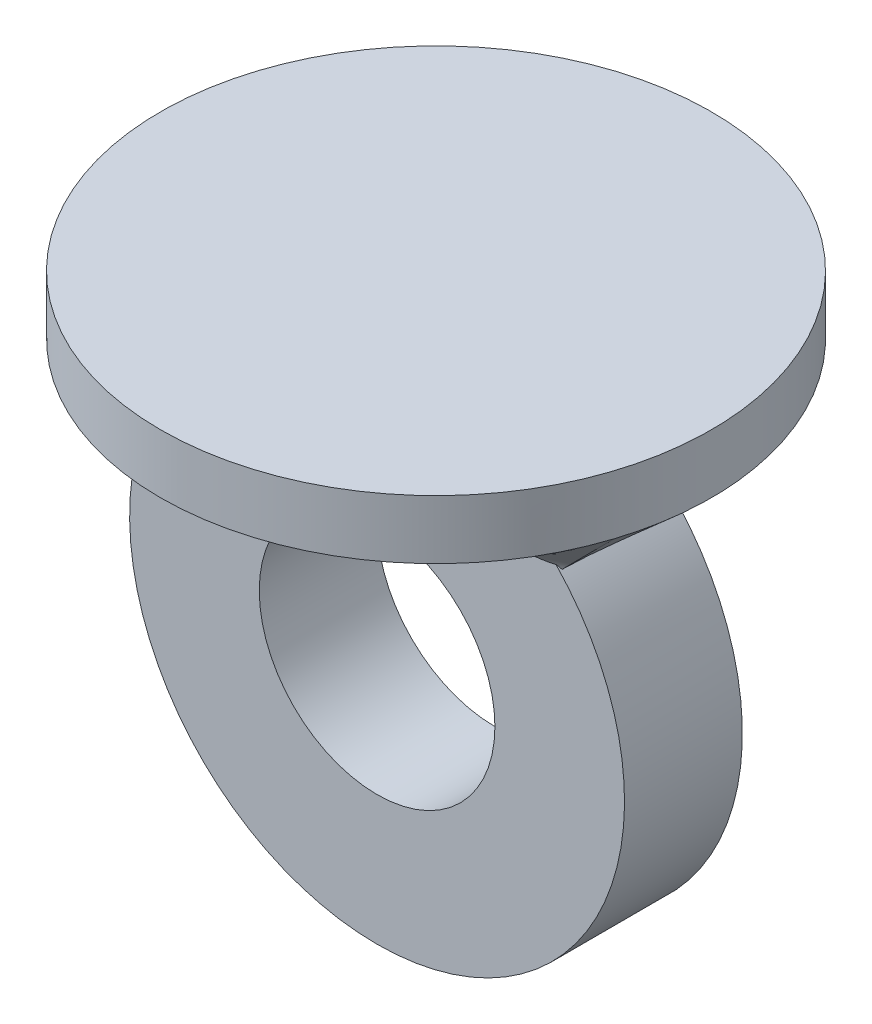
ISO-10303-21;
HEADER;
FILE_DESCRIPTION(('STEP AP214'),'2;1');
FILE_NAME('part.step','',(''),(''),'','','');
FILE_SCHEMA(('AUTOMOTIVE_DESIGN { 1 0 10303 214 1 1 1 1 }'));
ENDSEC;
DATA;
#1=APPLICATION_CONTEXT('core data for automotive mechanical design processes');
#2=APPLICATION_PROTOCOL_DEFINITION('international standard','automotive_design',2000,#1);
#3=PRODUCT_CONTEXT('',#1,'mechanical');
#4=PRODUCT('Part','Part','',(#3));
#5=PRODUCT_RELATED_PRODUCT_CATEGORY('part','',(#4));
#6=PRODUCT_DEFINITION_FORMATION('','',#4);
#7=PRODUCT_DEFINITION_CONTEXT('part definition',#1,'design');
#8=PRODUCT_DEFINITION('design','',#6,#7);
#9=PRODUCT_DEFINITION_SHAPE('','',#8);
#10=(LENGTH_UNIT() NAMED_UNIT(*) SI_UNIT(.MILLI.,.METRE.));
#11=(NAMED_UNIT(*) PLANE_ANGLE_UNIT() SI_UNIT($,.RADIAN.));
#12=(NAMED_UNIT(*) SI_UNIT($,.STERADIAN.) SOLID_ANGLE_UNIT());
#13=UNCERTAINTY_MEASURE_WITH_UNIT(LENGTH_MEASURE(1.E-05),#10,'distance_accuracy_value','');
#14=(GEOMETRIC_REPRESENTATION_CONTEXT(3) GLOBAL_UNCERTAINTY_ASSIGNED_CONTEXT((#13)) GLOBAL_UNIT_ASSIGNED_CONTEXT((#10,
#11,#12)) REPRESENTATION_CONTEXT('',''));
#15=CARTESIAN_POINT('',(0.,0.,0.));
#16=DIRECTION('',(0.,0.,1.));
#17=DIRECTION('',(1.,0.,0.));
#18=AXIS2_PLACEMENT_3D('',#15,#16,#17);
#19=CARTESIAN_POINT('',(0.,0.,10.));
#20=DIRECTION('',(0.,0.,1.));
#21=DIRECTION('',(1.,0.,0.));
#22=AXIS2_PLACEMENT_3D('',#19,#20,#21);
#23=PLANE('',#22);
#24=CARTESIAN_POINT('',(-32.1825013917067,29.5977568664693,10.));
#25=CARTESIAN_POINT('',(-32.075767011709,29.5547917143863,10.));
#26=CARTESIAN_POINT('',(-31.9684682715531,29.5132465801244,10.));
#27=CARTESIAN_POINT('',(-31.7528502433306,29.4329207301902,10.));
#28=CARTESIAN_POINT('',(-31.6445310373815,29.3941397941969,10.));
#29=CARTESIAN_POINT('',(-31.3192851187044,29.2822005429976,10.));
#30=CARTESIAN_POINT('',(-31.1009830933096,29.2130107932829,10.));
#31=CARTESIAN_POINT('',(-30.6621685375131,29.0844881737043,10.));
#32=CARTESIAN_POINT('',(-30.4416635878874,29.0251291359534,10.));
#33=CARTESIAN_POINT('',(-29.9987982692908,28.9149363390609,10.));
#34=CARTESIAN_POINT('',(-29.7764401359967,28.8640935333309,10.));
#35=CARTESIAN_POINT('',(-29.3302173163318,28.7696736594412,10.));
#36=CARTESIAN_POINT('',(-29.1063527370166,28.7260960805352,10.));
#37=CARTESIAN_POINT('',(-28.6588147501823,28.6453215271117,10.));
#38=CARTESIAN_POINT('',(-28.4351476477827,28.6080892979108,10.));
#39=CARTESIAN_POINT('',(-27.9868431390429,28.5387044137173,10.));
#40=CARTESIAN_POINT('',(-27.7622050793463,28.5065560183701,10.));
#41=CARTESIAN_POINT('',(-27.3121882712533,28.4465224021638,10.));
#42=CARTESIAN_POINT('',(-27.0868090845065,28.4186404962298,10.));
#43=CARTESIAN_POINT('',(-26.6355226949521,28.3664627829679,10.));
#44=CARTESIAN_POINT('',(-26.4096152813826,28.3421688129533,10.));
#45=CARTESIAN_POINT('',(-25.9574713037801,28.296613433879,10.));
#46=CARTESIAN_POINT('',(-25.7312347046639,28.2753523762824,10.));
#47=CARTESIAN_POINT('',(-24.9978615322365,28.2105826919678,10.));
#48=CARTESIAN_POINT('',(-24.490274295859,28.1721785070898,10.));
#49=CARTESIAN_POINT('',(-23.4747901326137,28.1042096630527,9.99999999999999));
#50=CARTESIAN_POINT('',(-22.9668934847744,28.0746406230142,10.));
#51=CARTESIAN_POINT('',(-21.9508717372016,28.0218459195113,10.));
#52=CARTESIAN_POINT('',(-21.4427466984482,27.9986190633282,10.));
#53=CARTESIAN_POINT('',(-20.4263369619175,27.9568389136714,10.));
#54=CARTESIAN_POINT('',(-19.9180522742432,27.9382853678993,10.));
#55=CARTESIAN_POINT('',(-18.9013651363332,27.9047081313804,10.));
#56=CARTESIAN_POINT('',(-18.3929626853916,27.8896844623722,10.));
#57=CARTESIAN_POINT('',(-17.3739066103979,27.862320770538,10.));
#58=CARTESIAN_POINT('',(-16.8632526754423,27.849992523632,10.));
#59=CARTESIAN_POINT('',(-15.8418926860932,27.8275239742769,10.));
#60=CARTESIAN_POINT('',(-15.3311866312657,27.8173836918372,10.));
#61=CARTESIAN_POINT('',(-14.3097358237945,27.7988735075635,10.));
#62=CARTESIAN_POINT('',(-13.798991070715,27.7905036300917,10.));
#63=CARTESIAN_POINT('',(-12.7774746773729,27.7752244854445,10.));
#64=CARTESIAN_POINT('',(-12.2667030368866,27.7683152333873,10.));
#65=CARTESIAN_POINT('',(-11.2451434649668,27.7557282396028,10.));
#66=CARTESIAN_POINT('',(-10.7343555334953,27.7500505009913,9.99999999999999));
#67=CARTESIAN_POINT('',(-9.58707425075785,27.7384802083656,9.99999999999999));
#68=CARTESIAN_POINT('',(-8.95057797959353,27.7328786043613,10.));
#69=CARTESIAN_POINT('',(-7.67758059548746,27.7230673564349,10.));
#70=CARTESIAN_POINT('',(-7.0410794826399,27.7188577000663,10.));
#71=CARTESIAN_POINT('',(-5.76807701702533,27.7116538706059,10.));
#72=CARTESIAN_POINT('',(-5.13157566432841,27.7086596849856,10.));
#73=CARTESIAN_POINT('',(-3.85857705274178,27.7037772142361,10.));
#74=CARTESIAN_POINT('',(-3.22207979390651,27.7018889147215,10.));
#75=CARTESIAN_POINT('',(-1.94981354499367,27.6991442544296,10.));
#76=CARTESIAN_POINT('',(-1.31404455743504,27.6982867118549,10.));
#77=CARTESIAN_POINT('',(-0.0425032036194116,27.6975742936237,10.));
#78=CARTESIAN_POINT('',(0.59326916264005,27.6977194224184,10.));
#79=CARTESIAN_POINT('',(1.86482905623398,27.6990125516978,10.));
#80=CARTESIAN_POINT('',(2.50061658354272,27.700160577693,10.));
#81=CARTESIAN_POINT('',(3.77221856105413,27.7035052459355,10.));
#82=CARTESIAN_POINT('',(4.40803301113034,27.7057019370593,10.));
#83=CARTESIAN_POINT('',(5.6096475009654,27.7109193596181,10.));
#84=CARTESIAN_POINT('',(6.17544804823005,27.7138227222655,10.));
#85=CARTESIAN_POINT('',(7.30703522468366,27.7206128384099,10.));
#86=CARTESIAN_POINT('',(7.87282185395597,27.7244995778523,10.));
#87=CARTESIAN_POINT('',(9.00433768192947,27.7333838113051,10.));
#88=CARTESIAN_POINT('',(9.57006688137512,27.7383812094836,10.));
#89=CARTESIAN_POINT('',(10.7014240600694,27.7496564624957,10.));
#90=CARTESIAN_POINT('',(11.2670520412937,27.7559341166566,10.));
#91=CARTESIAN_POINT('',(12.3978748095129,27.7700049348408,10.));
#92=CARTESIAN_POINT('',(12.9630696101968,27.7777969848665,10.));
#93=CARTESIAN_POINT('',(14.0934543783137,27.7952206165606,10.));
#94=CARTESIAN_POINT('',(14.6586443446072,27.8048522733123,10.));
#95=CARTESIAN_POINT('',(15.7891520290327,27.8264041565437,10.));
#96=CARTESIAN_POINT('',(16.3544697341689,27.838325073604,10.));
#97=CARTESIAN_POINT('',(17.4853633145811,27.8650854831311,10.));
#98=CARTESIAN_POINT('',(18.0509391512399,27.8799266509986,10.));
#99=CARTESIAN_POINT('',(18.9967927578597,27.9079457955823,10.));
#100=CARTESIAN_POINT('',(19.3771013952374,27.9200769768301,10.));
#101=CARTESIAN_POINT('',(20.1376839887451,27.9464501227936,10.));
#102=CARTESIAN_POINT('',(20.5179579377284,27.960692296085,10.));
#103=CARTESIAN_POINT('',(21.278297576078,27.9917799166559,10.));
#104=CARTESIAN_POINT('',(21.6583632939543,28.0086246580792,10.));
#105=CARTESIAN_POINT('',(22.4181054100857,28.0455682870926,10.));
#106=CARTESIAN_POINT('',(22.7977819042321,28.0656651759337,10.));
#107=CARTESIAN_POINT('',(23.5565548819354,28.1099796315704,10.));
#108=CARTESIAN_POINT('',(23.9356515798445,28.1341934687022,10.));
#109=CARTESIAN_POINT('',(24.6930590942261,28.1879373177651,10.));
#110=CARTESIAN_POINT('',(25.0713703169309,28.2174615098227,10.));
#111=CARTESIAN_POINT('',(25.8292695664056,28.2836760048428,10.));
#112=CARTESIAN_POINT('',(26.2088546206955,28.3204011208385,10.));
#113=CARTESIAN_POINT('',(26.9669110834162,28.4032563326045,10.));
#114=CARTESIAN_POINT('',(27.3453827627778,28.4493839079241,10.));
#115=CARTESIAN_POINT('',(28.1006875313549,28.554289237546,10.));
#116=CARTESIAN_POINT('',(28.4775203872133,28.6130687368693,10.));
#117=CARTESIAN_POINT('',(29.0407646410578,28.7140504747152,10.));
#118=CARTESIAN_POINT('',(29.2283201665819,28.7498785442629,10.));
#119=CARTESIAN_POINT('',(29.6024349756906,28.8264639941179,10.));
#120=CARTESIAN_POINT('',(29.7889942340777,28.8672214984892,10.));
#121=CARTESIAN_POINT('',(30.1616756000045,28.9545542547658,10.));
#122=CARTESIAN_POINT('',(30.3477915688158,29.0011558578861,10.));
#123=CARTESIAN_POINT('',(30.7183009220829,29.1007227712968,10.));
#124=CARTESIAN_POINT('',(30.902694485727,29.1536874114879,10.));
#125=CARTESIAN_POINT('',(31.27126326333,29.2672438429345,10.));
#126=CARTESIAN_POINT('',(31.455415632564,29.3279102335255,10.));
#127=CARTESIAN_POINT('',(31.8210843096839,29.4569400045516,10.));
#128=CARTESIAN_POINT('',(32.0025995016742,29.5253065419523,10.));
#129=CARTESIAN_POINT('',(32.1825013917067,29.5977568664693,9.99999999999999));
#130=B_SPLINE_CURVE_WITH_KNOTS('',3,(#24,#25,#26,#27,#28,#29,#30,#31,#32,#33,#34,#35,#36,#37,
#38,#39,#40,#41,#42,#43,#44,#45,#46,#47,#48,#49,#50,#51,#52,#53,#54,#55,#56,#57,#58,#59,#60,#61,
#62,#63,#64,#65,#66,#67,#68,#69,#70,#71,#72,#73,#74,#75,#76,#77,#78,#79,#80,#81,#82,#83,#84,#85,
#86,#87,#88,#89,#90,#91,#92,#93,#94,#95,#96,#97,#98,#99,#100,#101,#102,#103,#104,#105,#106,#107,
#108,#109,#110,#111,#112,#113,#114,#115,#116,#117,#118,#119,#120,#121,#122,#123,#124,#125,#126,
#127,#128,#129),.UNSPECIFIED.,.F.,.F.,(4,2,2,2,2,2,2,2,2,2,2,2,2,2,2,2,2,2,2,2,2,2,2,2,2,2,2,2,
2,2,2,2,2,2,2,2,2,2,2,2,2,2,2,2,2,2,2,2,2,2,2,2,4),(0.,0.34515060100749,0.690273660871659,
1.37701137638433,2.06189064871298,2.74603771180538,3.43013665897654,4.11030122366187,
4.79103269945431,5.47229042511393,6.15389580912976,6.83558011560258,8.36256247588858,
9.88878642535847,11.4147231533479,12.9405774828212,14.4664412089264,15.9988436100245,
17.5312600246833,19.0636975253463,20.59615088674,22.1286081253338,24.0381690205809,
25.9477128404469,27.8572369770863,29.7667362740769,31.6740441714654,33.5813605361529,
35.4887254181003,37.3961792077325,39.0936024441115,40.7910014221842,42.4882539990085,
44.1852407455615,45.8809838726502,47.5767962262463,49.2731209462554,50.9704217311576,
52.1119233799953,53.2535378896601,54.3948433177676,55.5354499524835,56.6750287310045,
57.813366116981,58.9573489053896,60.1010254367636,61.2448598113017,61.8176472824928,
62.3904491725989,62.9659335503597,63.5413573761863,64.122854397545,64.704590699389),.UNSPECIFIED.);
#131=CARTESIAN_POINT('',(-30.3726341892173,29.0086727102084,10.));
#132=VERTEX_POINT('',#131);
#133=CARTESIAN_POINT('',(30.3726341892173,29.0086727102084,10.));
#134=VERTEX_POINT('',#133);
#135=EDGE_CURVE('E341',#132,#134,#130,.T.);
#136=ORIENTED_EDGE('',*,*,#135,.F.);
#137=CARTESIAN_POINT('',(0.,0.,10.));
#138=DIRECTION('',(0.,0.,1.));
#139=DIRECTION('',(1.,0.,0.));
#140=AXIS2_PLACEMENT_3D('',#137,#138,#139);
#141=CIRCLE('',#140,42.);
#142=EDGE_CURVE('E273',#132,#134,#141,.T.);
#143=ORIENTED_EDGE('',*,*,#142,.T.);
#144=EDGE_LOOP('',(#136,#143));
#145=FACE_BOUND('',#144,.T.);
#146=CARTESIAN_POINT('',(0.,0.,10.));
#147=DIRECTION('',(0.,0.,1.));
#148=DIRECTION('',(1.,0.,0.));
#149=AXIS2_PLACEMENT_3D('',#146,#147,#148);
#150=CIRCLE('',#149,20.);
#151=CARTESIAN_POINT('',(20.,0.,10.));
#152=VERTEX_POINT('',#151);
#153=EDGE_CURVE('E264',#152,#152,#150,.T.);
#154=ORIENTED_EDGE('',*,*,#153,.F.);
#155=EDGE_LOOP('',(#154));
#156=FACE_BOUND('',#155,.T.);
#157=ADVANCED_FACE('F70',(#145,#156),#23,.T.);
#158=CARTESIAN_POINT('',(0.,0.,-10.));
#159=DIRECTION('',(0.,0.,1.));
#160=DIRECTION('',(1.,0.,0.));
#161=AXIS2_PLACEMENT_3D('',#158,#159,#160);
#162=PLANE('',#161);
#163=CARTESIAN_POINT('',(0.,0.,-10.));
#164=DIRECTION('',(0.,0.,1.));
#165=DIRECTION('',(1.,0.,0.));
#166=AXIS2_PLACEMENT_3D('',#163,#164,#165);
#167=CIRCLE('',#166,42.);
#168=CARTESIAN_POINT('',(-30.9698593922663,28.370192266237,-10.));
#169=VERTEX_POINT('',#168);
#170=CARTESIAN_POINT('',(30.9698593922663,28.370192266237,-10.));
#171=VERTEX_POINT('',#170);
#172=EDGE_CURVE('E268',#169,#171,#167,.T.);
#173=ORIENTED_EDGE('',*,*,#172,.F.);
#174=CARTESIAN_POINT('',(-42.504,39.1569296947997,-10.));
#175=CARTESIAN_POINT('',(-42.1599961088552,38.8462205074388,-10.));
#176=CARTESIAN_POINT('',(-41.8162758853131,38.5351973140112,-10.));
#177=CARTESIAN_POINT('',(-41.1294773484339,37.9124420135145,-10.));
#178=CARTESIAN_POINT('',(-40.7863990360711,37.600709905371,-10.));
#179=CARTESIAN_POINT('',(-39.7581984182432,36.6642920436308,-10.));
#180=CARTESIAN_POINT('',(-39.0741525822811,36.0384227870938,-10.));
#181=CARTESIAN_POINT('',(-37.6807671733742,34.7560711014441,-10.));
#182=CARTESIAN_POINT('',(-36.9715859137047,34.0994165352686,-10.));
#183=CARTESIAN_POINT('',(-35.5584161009907,32.7805836769882,-10.));
#184=CARTESIAN_POINT('',(-34.8544273573228,32.1184055895793,-9.99999999999999));
#185=CARTESIAN_POINT('',(-33.8034635632004,31.1195872464888,-9.99999999999999));
#186=CARTESIAN_POINT('',(-33.4539119090333,30.785657646922,-10.));
#187=CARTESIAN_POINT('',(-32.7568122954551,30.1157159058085,-10.));
#188=CARTESIAN_POINT('',(-32.4092643255722,29.7797037751648,-10.));
#189=CARTESIAN_POINT('',(-31.7164648889759,29.1052611674635,-10.));
#190=CARTESIAN_POINT('',(-31.371213612958,28.7668304943155,-10.));
#191=CARTESIAN_POINT('',(-30.6834479822476,28.0871880161112,-10.));
#192=CARTESIAN_POINT('',(-30.3409336777421,27.7459761602881,-10.));
#193=CARTESIAN_POINT('',(-30.,27.4031848686996,-10.));
#194=B_SPLINE_CURVE_WITH_KNOTS('',3,(#174,#175,#176,#177,#178,#179,#180,#181,#182,#183,#184,
#185,#186,#187,#188,#189,#190,#191,#192,#193),.UNSPECIFIED.,.F.,.F.,(4,2,2,2,2,2,2,2,2,4),(0.,
1.39065048935161,2.78130308789954,5.56277860477432,8.46227513942729,11.3616646950122,
12.8119190805869,14.2621658798395,15.7125316272428,17.1629239087652),.UNSPECIFIED.);
#195=CARTESIAN_POINT('',(-30.,27.4031848686996,-10.));
#196=VERTEX_POINT('',#195);
#197=EDGE_CURVE('E104',#169,#196,#194,.T.);
#198=ORIENTED_EDGE('',*,*,#197,.T.);
#199=DIRECTION('',(-1.,0.,0.));
#200=VECTOR('',#199,1.);
#201=CARTESIAN_POINT('',(-30.,27.4031848686996,-10.));
#202=LINE('',#201,#200);
#203=CARTESIAN_POINT('',(30.,27.4031848686996,-10.));
#204=VERTEX_POINT('',#203);
#205=EDGE_CURVE('E230',#204,#196,#202,.T.);
#206=ORIENTED_EDGE('',*,*,#205,.F.);
#207=CARTESIAN_POINT('',(30.,27.4031848686996,-10.));
#208=CARTESIAN_POINT('',(30.3269578569078,27.7319271929921,-10.));
#209=CARTESIAN_POINT('',(30.6553715737736,28.0592152239493,-10.));
#210=CARTESIAN_POINT('',(31.3147327652535,28.7112188337904,-10.));
#211=CARTESIAN_POINT('',(31.645680197379,29.0359344556267,-10.));
#212=CARTESIAN_POINT('',(32.3097156201352,29.6831148217987,-10.));
#213=CARTESIAN_POINT('',(32.6428034397722,30.0055797417506,-10.));
#214=CARTESIAN_POINT('',(33.310856549805,30.6485609859155,-10.));
#215=CARTESIAN_POINT('',(33.6458218493172,30.9690773006508,-10.));
#216=CARTESIAN_POINT('',(34.6816083984801,31.9551705372669,-9.99999999999999));
#217=CARTESIAN_POINT('',(35.3851395855053,32.617901647574,-10.));
#218=CARTESIAN_POINT('',(36.797512868139,33.9377223872059,-10.));
#219=CARTESIAN_POINT('',(37.5063551670509,34.5948117984854,-9.99999999999999));
#220=CARTESIAN_POINT('',(38.9282403942688,35.9047206744139,-9.99999999999999));
#221=CARTESIAN_POINT('',(39.6412841543265,36.5575392356317,-10.));
#222=CARTESIAN_POINT('',(40.7131891612899,37.5341483820797,-10.));
#223=CARTESIAN_POINT('',(41.0708688950158,37.8592376413404,-10.));
#224=CARTESIAN_POINT('',(41.7869296772551,38.5086415542115,-10.));
#225=CARTESIAN_POINT('',(42.1453107244289,38.8329562092989,-10.));
#226=CARTESIAN_POINT('',(42.504,39.1569296947997,-10.));
#227=B_SPLINE_CURVE_WITH_KNOTS('',3,(#207,#208,#209,#210,#211,#212,#213,#214,#215,#216,#217,
#218,#219,#220,#221,#222,#223,#224,#225,#226),.UNSPECIFIED.,.F.,.F.,(4,2,2,2,2,2,2,2,2,4),(0.,
1.39094418696793,2.78186509964687,4.17267624116143,5.5634941419678,8.46301901819385,
11.3626554578501,14.2628866282855,15.7129066146114,17.1629238339862),.UNSPECIFIED.);
#228=EDGE_CURVE('E154',#204,#171,#227,.T.);
#229=ORIENTED_EDGE('',*,*,#228,.T.);
#230=EDGE_LOOP('',(#173,#198,#206,#229));
#231=FACE_BOUND('',#230,.T.);
#232=CARTESIAN_POINT('',(0.,0.,-10.));
#233=DIRECTION('',(0.,0.,1.));
#234=DIRECTION('',(1.,0.,0.));
#235=AXIS2_PLACEMENT_3D('',#232,#233,#234);
#236=CIRCLE('',#235,20.);
#237=CARTESIAN_POINT('',(20.,0.,-10.));
#238=VERTEX_POINT('',#237);
#239=EDGE_CURVE('E269',#238,#238,#236,.T.);
#240=ORIENTED_EDGE('',*,*,#239,.T.);
#241=EDGE_LOOP('',(#240));
#242=FACE_BOUND('',#241,.T.);
#243=ADVANCED_FACE('F235',(#231,#242),#162,.F.);
#244=CARTESIAN_POINT('',(0.,0.,10.));
#245=DIRECTION('',(0.,0.,-1.));
#246=DIRECTION('',(-1.,0.,0.));
#247=AXIS2_PLACEMENT_3D('',#244,#245,#246);
#248=CYLINDRICAL_SURFACE('',#247,42.);
#249=CARTESIAN_POINT('',(-30.3726341892173,29.0086727102084,10.));
#250=CARTESIAN_POINT('',(-30.4047318871769,28.9750658081867,9.972994001628));
#251=CARTESIAN_POINT('',(-30.4369904238036,28.9411788289458,9.94652537972688));
#252=CARTESIAN_POINT('',(-30.5017780025642,28.8728895516682,9.89475032852523));
#253=CARTESIAN_POINT('',(-30.5343066428125,28.8384879735092,9.86944244635664));
#254=CARTESIAN_POINT('',(-30.5996435113385,28.7691516116628,9.82002347300294));
#255=CARTESIAN_POINT('',(-30.632451531988,28.7342172108797,9.79591157085521));
#256=CARTESIAN_POINT('',(-30.6983582748635,28.6637946748627,9.74891805442425));
#257=CARTESIAN_POINT('',(-30.7314570125598,28.6283065100819,9.72603650608014));
#258=CARTESIAN_POINT('',(-30.7979494775177,28.5567626688333,9.68154348783121));
#259=CARTESIAN_POINT('',(-30.8313433786289,28.5207066465582,9.65993283302351));
#260=CARTESIAN_POINT('',(-30.8984321997278,28.4480111473423,9.61801911691549));
#261=CARTESIAN_POINT('',(-30.9321274665449,28.4113709454181,9.59771786877566));
#262=CARTESIAN_POINT('',(-30.9659414732091,28.3744686060865,9.57811162282247));
#263=B_SPLINE_CURVE_WITH_KNOTS('',3,(#249,#250,#251,#252,#253,#254,#255,#256,#257,#258,#259,
#260,#261,#262),.UNSPECIFIED.,.F.,.F.,(4,2,2,2,2,2,4),(0.,0.161246600711385,0.322285534381288,
0.483213735663602,0.644150553092745,0.80518948746697,0.966446829228816),.UNSPECIFIED.);
#264=CARTESIAN_POINT('',(-30.9659414732091,28.3744686060865,9.57811162282247));
#265=VERTEX_POINT('',#264);
#266=EDGE_CURVE('E82',#132,#265,#263,.T.);
#267=ORIENTED_EDGE('',*,*,#266,.T.);
#268=CARTESIAN_POINT('',(-30.9659414732091,28.3744686060865,9.57811162282247));
#269=CARTESIAN_POINT('',(-30.9724263123722,28.3673913368973,9.11463778112359));
#270=CARTESIAN_POINT('',(-30.9783621558404,28.3609086721953,8.65114781032963));
#271=CARTESIAN_POINT('',(-30.9892086424699,28.3490566721729,7.72414225534475));
#272=CARTESIAN_POINT('',(-30.9941192871204,28.3436873352353,7.260626671192));
#273=CARTESIAN_POINT('',(-31.0074226006476,28.3291355063494,5.87005302226848));
#274=CARTESIAN_POINT('',(-31.0143866980093,28.321509142896,4.94296448510695));
#275=CARTESIAN_POINT('',(-31.0248570189289,28.3100389467543,3.08875250223363));
#276=CARTESIAN_POINT('',(-31.0283632667882,28.3061950874829,2.16162905681297));
#277=CARTESIAN_POINT('',(-31.0321043441145,28.3020937041428,0.307365262019333));
#278=CARTESIAN_POINT('',(-31.0323391659846,28.3018361884022,-0.61977508738789));
#279=CARTESIAN_POINT('',(-31.0298714893251,28.3045416281205,-2.2513806401294));
#280=CARTESIAN_POINT('',(-31.0278608824757,28.3067459984851,-2.95584831691996));
#281=CARTESIAN_POINT('',(-31.0218959316321,28.313282960537,-4.36476565137839));
#282=CARTESIAN_POINT('',(-31.0179415881194,28.317615551697,-5.06921530905069));
#283=CARTESIAN_POINT('',(-31.0079658203701,28.328538864587,-6.47808430186235));
#284=CARTESIAN_POINT('',(-31.0019443922292,28.3351295905822,-7.18250363694193));
#285=CARTESIAN_POINT('',(-30.9876433291572,28.350768251675,-8.59129351208068));
#286=CARTESIAN_POINT('',(-30.9793636890218,28.3598161924356,-9.29566405202365));
#287=CARTESIAN_POINT('',(-30.9698593922663,28.370192266237,-10.));
#288=B_SPLINE_CURVE_WITH_KNOTS('',3,(#268,#269,#270,#271,#272,#273,#274,#275,#276,#277,#278,
#279,#280,#281,#282,#283,#284,#285,#286,#287),.UNSPECIFIED.,.F.,.F.,(4,2,2,2,2,2,2,2,2,4),(0.,
1.39071793749706,2.78143385481703,5.56285495967014,8.34425651684523,11.125664532962,
13.2390811379036,15.3524972192154,17.4659172923984,19.5793422362308),.UNSPECIFIED.);
#289=EDGE_CURVE('E12',#265,#169,#288,.T.);
#290=ORIENTED_EDGE('',*,*,#289,.T.);
#291=ORIENTED_EDGE('',*,*,#172,.T.);
#292=CARTESIAN_POINT('',(30.9698593922663,28.370192266237,-10.));
#293=CARTESIAN_POINT('',(30.9761230584683,28.3633544835338,-9.53652000339038));
#294=CARTESIAN_POINT('',(30.9818467497392,28.3571019303903,-9.073024672993));
#295=CARTESIAN_POINT('',(30.9922825778299,28.3456960084429,-8.14600969332072));
#296=CARTESIAN_POINT('',(30.9969947160593,28.3405426381074,-7.68249004408061));
#297=CARTESIAN_POINT('',(31.0097163906021,28.3266243932077,-6.29190517642858));
#298=CARTESIAN_POINT('',(31.0163112260647,28.3194013418107,-5.3648110654968));
#299=CARTESIAN_POINT('',(31.0260698509181,28.3087096128952,-3.51059077955405));
#300=CARTESIAN_POINT('',(31.0292336632847,28.3052409102358,-2.58346460479937));
#301=CARTESIAN_POINT('',(31.0322934874375,28.3018862710669,-0.729198311805795));
#302=CARTESIAN_POINT('',(31.0321894928202,28.3020003415783,0.197941806456856));
#303=CARTESIAN_POINT('',(31.0291235228485,28.3053616161616,1.82954480674592));
#304=CARTESIAN_POINT('',(31.0268539265521,28.3078497785262,2.53401071751754));
#305=CARTESIAN_POINT('',(31.0203571828261,28.3149688863681,3.94292273757553));
#306=CARTESIAN_POINT('',(31.0161300360066,28.3195998311775,4.647368846868));
#307=CARTESIAN_POINT('',(31.0055927161504,28.3311363233916,6.05622948081372));
#308=CARTESIAN_POINT('',(30.9992825368957,28.3380418775863,6.76064400536642));
#309=CARTESIAN_POINT('',(30.9843767136684,28.354338439013,8.16942166858117));
#310=CARTESIAN_POINT('',(30.9757810639189,28.3637294525277,8.87378480710884));
#311=CARTESIAN_POINT('',(30.9659414732091,28.3744686060865,9.57811162282247));
#312=B_SPLINE_CURVE_WITH_KNOTS('',3,(#292,#293,#294,#295,#296,#297,#298,#299,#300,#301,#302,
#303,#304,#305,#306,#307,#308,#309,#310,#311),.UNSPECIFIED.,.F.,.F.,(4,2,2,2,2,2,2,2,2,4),(0.,
1.39071656768546,2.78143119753556,5.56285153791682,8.3442532523933,11.1256604172853,
13.2390768748331,15.3524926736006,17.4659147811685,19.5793422310043),.UNSPECIFIED.);
#313=CARTESIAN_POINT('',(30.9659414732091,28.3744686060865,9.57811162282246));
#314=VERTEX_POINT('',#313);
#315=EDGE_CURVE('E277',#171,#314,#312,.T.);
#316=ORIENTED_EDGE('',*,*,#315,.T.);
#317=CARTESIAN_POINT('',(30.9659414732091,28.3744686060865,9.57811162282247));
#318=CARTESIAN_POINT('',(30.9321274665449,28.4113709454181,9.59771786877566));
#319=CARTESIAN_POINT('',(30.8984321997278,28.4480111473423,9.61801911691548));
#320=CARTESIAN_POINT('',(30.8313433786289,28.5207066465582,9.65993283302351));
#321=CARTESIAN_POINT('',(30.7979494775177,28.5567626688333,9.68154348783121));
#322=CARTESIAN_POINT('',(30.7314570125598,28.6283065100819,9.72603650608015));
#323=CARTESIAN_POINT('',(30.6983582748635,28.6637946748627,9.74891805442425));
#324=CARTESIAN_POINT('',(30.632451531988,28.7342172108797,9.79591157085521));
#325=CARTESIAN_POINT('',(30.5996435113385,28.7691516116629,9.82002347300294));
#326=CARTESIAN_POINT('',(30.5343066428125,28.8384879735092,9.86944244635664));
#327=CARTESIAN_POINT('',(30.5017780025642,28.8728895516682,9.89475032852523));
#328=CARTESIAN_POINT('',(30.4369904238036,28.9411788289458,9.94652537972689));
#329=CARTESIAN_POINT('',(30.4047318871769,28.9750658081867,9.972994001628));
#330=CARTESIAN_POINT('',(30.3726341892173,29.0086727102084,10.));
#331=B_SPLINE_CURVE_WITH_KNOTS('',3,(#317,#318,#319,#320,#321,#322,#323,#324,#325,#326,#327,
#328,#329,#330),.UNSPECIFIED.,.F.,.F.,(4,2,2,2,2,2,4),(0.,0.161257341761849,0.322296276136074,
0.483233093565221,0.644161294847537,0.805200228517442,0.966446829228829),.UNSPECIFIED.);
#332=EDGE_CURVE('E287',#314,#134,#331,.T.);
#333=ORIENTED_EDGE('',*,*,#332,.T.);
#334=ORIENTED_EDGE('',*,*,#142,.F.);
#335=EDGE_LOOP('',(#267,#290,#291,#316,#333,#334));
#336=FACE_BOUND('',#335,.T.);
#337=ADVANCED_FACE('F72',(#336),#248,.T.);
#338=CARTESIAN_POINT('',(0.,0.,10.));
#339=DIRECTION('',(0.,0.,-1.));
#340=DIRECTION('',(-1.,0.,0.));
#341=AXIS2_PLACEMENT_3D('',#338,#339,#340);
#342=CYLINDRICAL_SURFACE('',#341,20.);
#343=ORIENTED_EDGE('',*,*,#153,.T.);
#344=EDGE_LOOP('',(#343));
#345=FACE_BOUND('',#344,.T.);
#346=ORIENTED_EDGE('',*,*,#239,.F.);
#347=EDGE_LOOP('',(#346));
#348=FACE_BOUND('',#347,.T.);
#349=ADVANCED_FACE('F197',(#345,#348),#342,.F.);
#350=CARTESIAN_POINT('',(-44.5165295879681,42.,14.2772929312094));
#351=CARTESIAN_POINT('',(-30.,27.4031848686996,9.24313471425892));
#352=CARTESIAN_POINT('',(-45.2432358034532,42.,12.0114265026594));
#353=CARTESIAN_POINT('',(-30.,27.4031848686996,7.63954015473733));
#354=CARTESIAN_POINT('',(-45.804715592353,42.,9.66236265632588));
#355=CARTESIAN_POINT('',(-30.,27.4031848686996,6.03594559521576));
#356=CARTESIAN_POINT('',(-46.5581773162518,42.,4.87538178886217));
#357=CARTESIAN_POINT('',(-30.,27.4031848686996,2.8287564761726));
#358=CARTESIAN_POINT('',(-46.75,42.,2.43778103373846));
#359=CARTESIAN_POINT('',(-30.,27.4031848686996,1.22516191665102));
#360=CARTESIAN_POINT('',(-46.75,42.,-2.43778103373848));
#361=CARTESIAN_POINT('',(-30.,27.4031848686996,-1.98202720239213));
#362=CARTESIAN_POINT('',(-46.5581773162518,42.,-4.87538178886219));
#363=CARTESIAN_POINT('',(-30.,27.4031848686996,-3.58562176191371));
#364=CARTESIAN_POINT('',(-45.804715592353,42.,-9.6623626563259));
#365=CARTESIAN_POINT('',(-30.,27.4031848686996,-6.79281088095686));
#366=CARTESIAN_POINT('',(-45.2432358034532,42.,-12.0114265026594));
#367=CARTESIAN_POINT('',(-30.,27.4031848686996,-8.39640544047843));
#368=CARTESIAN_POINT('',(-44.5165295879681,42.,-14.2772929312094));
#369=CARTESIAN_POINT('',(-30.,27.4031848686996,-10.));
#370=B_SPLINE_SURFACE_WITH_KNOTS('',3,1,((#350,#351),(#352,#353),(#354,#355),(#356,#357),(#358,
#359),(#360,#361),(#362,#363),(#364,#365),(#366,#367),(#368,#369)),.UNSPECIFIED.,.F.,.F.,.F.,(4,
2,2,2,4),(2,2),(0.,0.25,0.5,0.75,1.),(0.,1.),.UNSPECIFIED.);
#371=DIRECTION('',(-0.684971071346937,0.688759392398242,0.237539745729076));
#372=VECTOR('',#371,1.);
#373=CARTESIAN_POINT('',(-37.258264793984,34.7015924343498,11.7602138227341));
#374=LINE('',#373,#372);
#375=CARTESIAN_POINT('',(-44.5167773758873,42.,14.2773724396286));
#376=VERTEX_POINT('',#375);
#377=EDGE_CURVE('E147',#265,#376,#374,.T.);
#378=CARTESIAN_POINT('',(0.,42.,0.));
#379=DIRECTION('',(0.,1.,0.));
#380=DIRECTION('',(0.,0.,1.));
#381=AXIS2_PLACEMENT_3D('',#378,#379,#380);
#382=CIRCLE('',#381,46.75);
#383=CARTESIAN_POINT('',(-44.5167736691861,42.,-14.2773712556055));
#384=VERTEX_POINT('',#383);
#385=EDGE_CURVE('E158',#384,#376,#382,.T.);
#386=DIRECTION('',(0.690409145262723,-0.69422754228476,0.203428935185873));
#387=VECTOR('',#386,1.);
#388=CARTESIAN_POINT('',(-37.258264793984,34.7015924343498,-12.1386464656047));
#389=LINE('',#388,#387);
#390=EDGE_CURVE('E162',#384,#196,#389,.T.);
#391=ORIENTED_EDGE('',*,*,#197,.F.);
#392=ORIENTED_EDGE('',*,*,#289,.F.);
#393=ORIENTED_EDGE('',*,*,#377,.T.);
#394=ORIENTED_EDGE('',*,*,#385,.F.);
#395=ORIENTED_EDGE('',*,*,#390,.T.);
#396=EDGE_LOOP('',(#391,#392,#393,#394,#395));
#397=FACE_BOUND('',#396,.T.);
#398=ADVANCED_FACE('F157',(#397),#370,.T.);
#399=CARTESIAN_POINT('',(44.5165295879681,42.,14.2772929312094));
#400=CARTESIAN_POINT('',(30.,27.4031848686996,9.24313471425892));
#401=CARTESIAN_POINT('',(43.9500629808306,42.,16.0435330440048));
#402=CARTESIAN_POINT('',(28.75,27.4031848686996,9.24313471425892));
#403=CARTESIAN_POINT('',(43.2537959444635,42.,17.8535395656189));
#404=CARTESIAN_POINT('',(27.5,27.4031848686996,9.24313471425892));
#405=CARTESIAN_POINT('',(41.5533319221058,42.,21.5165133048482));
#406=CARTESIAN_POINT('',(25.,27.4031848686996,9.24313471425892));
#407=CARTESIAN_POINT('',(40.548863631611,42.,23.3695516018573));
#408=CARTESIAN_POINT('',(23.75,27.4031848686996,9.24313471425892));
#409=CARTESIAN_POINT('',(38.1898429704235,42.,27.0533210120541));
#410=CARTESIAN_POINT('',(21.25,27.4031848686996,9.24313471425892));
#411=CARTESIAN_POINT('',(36.8349387742797,42.,28.8839994208983));
#412=CARTESIAN_POINT('',(20.,27.4031848686996,9.24313471425892));
#413=CARTESIAN_POINT('',(33.7488649362967,42.,32.4362798816849));
#414=CARTESIAN_POINT('',(17.5,27.4031848686996,9.24313471425892));
#415=CARTESIAN_POINT('',(32.017326977475,42.,34.1576377703582));
#416=CARTESIAN_POINT('',(16.25,27.4031848686996,9.24313471425892));
#417=CARTESIAN_POINT('',(28.1788873895655,42.,37.3872137276868));
#418=CARTESIAN_POINT('',(13.75,27.4031848686996,9.24313471425892));
#419=CARTESIAN_POINT('',(26.0717211637984,42.,38.8949677425243));
#420=CARTESIAN_POINT('',(12.5,27.4031848686996,9.24313471425892));
#421=CARTESIAN_POINT('',(21.5200205956278,42.,41.5865588104933));
#422=CARTESIAN_POINT('',(10.,27.4031848686996,9.24313471425892));
#423=CARTESIAN_POINT('',(19.0754716060327,42.,42.769771581774));
#424=CARTESIAN_POINT('',(8.75000000000002,27.4031848686996,9.24313471425892));
#425=CARTESIAN_POINT('',(13.9288440747187,42.,44.7114558127093));
#426=CARTESIAN_POINT('',(6.25000000000002,27.4031848686996,9.24313471425892));
#427=CARTESIAN_POINT('',(11.2270983309751,42.,45.4693095252829));
#428=CARTESIAN_POINT('',(5.00000000000002,27.4031848686996,9.24313471425892));
#429=CARTESIAN_POINT('',(5.6832666271517,42.,46.488776345308));
#430=CARTESIAN_POINT('',(2.50000000000002,27.4031848686996,9.24313471425892));
#431=CARTESIAN_POINT('',(2.84182652585649,42.,46.75));
#432=CARTESIAN_POINT('',(1.25000000000002,27.4031848686996,9.24313471425892));
#433=CARTESIAN_POINT('',(-2.8418265258565,42.,46.75));
#434=CARTESIAN_POINT('',(-1.24999999999999,27.4031848686996,9.24313471425892));
#435=CARTESIAN_POINT('',(-5.68326662715171,42.,46.488776345308));
#436=CARTESIAN_POINT('',(-2.49999999999999,27.4031848686996,9.24313471425892));
#437=CARTESIAN_POINT('',(-11.2270983309751,42.,45.4693095252829));
#438=CARTESIAN_POINT('',(-4.99999999999999,27.4031848686996,9.24313471425892));
#439=CARTESIAN_POINT('',(-13.9288440747187,42.,44.7114558127093));
#440=CARTESIAN_POINT('',(-6.24999999999999,27.4031848686996,9.24313471425892));
#441=CARTESIAN_POINT('',(-19.0754716060327,42.,42.769771581774));
#442=CARTESIAN_POINT('',(-8.74999999999999,27.4031848686996,9.24313471425892));
#443=CARTESIAN_POINT('',(-21.5200205956278,42.,41.5865588104933));
#444=CARTESIAN_POINT('',(-9.99999999999999,27.4031848686996,9.24313471425892));
#445=CARTESIAN_POINT('',(-26.0717211637985,42.,38.8949677425243));
#446=CARTESIAN_POINT('',(-12.5,27.4031848686996,9.24313471425892));
#447=CARTESIAN_POINT('',(-28.1788873895656,42.,37.3872137276868));
#448=CARTESIAN_POINT('',(-13.75,27.4031848686996,9.24313471425892));
#449=CARTESIAN_POINT('',(-32.017326977475,42.,34.1576377703581));
#450=CARTESIAN_POINT('',(-16.25,27.4031848686996,9.24313471425892));
#451=CARTESIAN_POINT('',(-33.7488649362967,42.,32.4362798816849));
#452=CARTESIAN_POINT('',(-17.5,27.4031848686996,9.24313471425892));
#453=CARTESIAN_POINT('',(-36.8349387742797,42.,28.8839994208983));
#454=CARTESIAN_POINT('',(-20.,27.4031848686996,9.24313471425892));
#455=CARTESIAN_POINT('',(-38.1898429704235,42.,27.0533210120541));
#456=CARTESIAN_POINT('',(-21.25,27.4031848686996,9.24313471425892));
#457=CARTESIAN_POINT('',(-40.548863631611,42.,23.3695516018572));
#458=CARTESIAN_POINT('',(-23.75,27.4031848686996,9.24313471425892));
#459=CARTESIAN_POINT('',(-41.5533319221058,42.,21.5165133048482));
#460=CARTESIAN_POINT('',(-25.,27.4031848686996,9.24313471425892));
#461=CARTESIAN_POINT('',(-43.2537959444635,42.,17.8535395656189));
#462=CARTESIAN_POINT('',(-27.5,27.4031848686996,9.24313471425892));
#463=CARTESIAN_POINT('',(-43.9500629808306,42.,16.0435330440048));
#464=CARTESIAN_POINT('',(-28.75,27.4031848686996,9.24313471425892));
#465=CARTESIAN_POINT('',(-44.5165295879681,42.,14.2772929312094));
#466=CARTESIAN_POINT('',(-30.,27.4031848686996,9.24313471425892));
#467=B_SPLINE_SURFACE_WITH_KNOTS('',3,1,((#399,#400),(#401,#402),(#403,#404),(#405,#406),(#407,
#408),(#409,#410),(#411,#412),(#413,#414),(#415,#416),(#417,#418),(#419,#420),(#421,#422),(#423,
#424),(#425,#426),(#427,#428),(#429,#430),(#431,#432),(#433,#434),(#435,#436),(#437,#438),(#439,
#440),(#441,#442),(#443,#444),(#445,#446),(#447,#448),(#449,#450),(#451,#452),(#453,#454),(#455,
#456),(#457,#458),(#459,#460),(#461,#462),(#463,#464),(#465,#466)),.UNSPECIFIED.,.F.,.F.,.F.,(4,
2,2,2,2,2,2,2,2,2,2,2,2,2,2,2,4),(2,2),(0.,0.0625,0.125,0.1875,0.25,0.3125,0.375,0.4375,0.5,
0.5625,0.625,0.6875,0.75,0.8125,0.875,0.9375,1.),(0.,1.),.UNSPECIFIED.);
#468=DIRECTION('',(-0.684971071346937,-0.688759392398242,-0.237539745729076));
#469=VECTOR('',#468,1.);
#470=CARTESIAN_POINT('',(37.258264793984,34.7015924343498,11.7602138227341));
#471=LINE('',#470,#469);
#472=CARTESIAN_POINT('',(44.5167727406228,42.,14.2773709589682));
#473=VERTEX_POINT('',#472);
#474=EDGE_CURVE('E94',#473,#314,#471,.T.);
#475=EDGE_CURVE('E143',#376,#473,#382,.T.);
#476=ORIENTED_EDGE('',*,*,#266,.F.);
#477=ORIENTED_EDGE('',*,*,#135,.T.);
#478=ORIENTED_EDGE('',*,*,#332,.F.);
#479=ORIENTED_EDGE('',*,*,#474,.F.);
#480=ORIENTED_EDGE('',*,*,#475,.F.);
#481=ORIENTED_EDGE('',*,*,#377,.F.);
#482=EDGE_LOOP('',(#476,#477,#478,#479,#480,#481));
#483=FACE_BOUND('',#482,.T.);
#484=ADVANCED_FACE('F146',(#483),#467,.T.);
#485=CARTESIAN_POINT('',(44.5165295879681,42.,-14.2772929312094));
#486=CARTESIAN_POINT('',(30.,27.4031848686996,-10.));
#487=CARTESIAN_POINT('',(45.2432358034531,42.,-12.0114265026594));
#488=CARTESIAN_POINT('',(30.,27.4031848686996,-8.39640544047842));
#489=CARTESIAN_POINT('',(45.804715592353,42.,-9.66236265632589));
#490=CARTESIAN_POINT('',(30.,27.4031848686996,-6.79281088095685));
#491=CARTESIAN_POINT('',(46.5581773162518,42.,-4.87538178886218));
#492=CARTESIAN_POINT('',(30.,27.4031848686996,-3.58562176191369));
#493=CARTESIAN_POINT('',(46.75,42.,-2.43778103373847));
#494=CARTESIAN_POINT('',(30.,27.4031848686996,-1.98202720239212));
#495=CARTESIAN_POINT('',(46.75,42.,2.43778103373847));
#496=CARTESIAN_POINT('',(30.,27.4031848686996,1.22516191665104));
#497=CARTESIAN_POINT('',(46.5581773162518,42.,4.87538178886218));
#498=CARTESIAN_POINT('',(30.,27.4031848686996,2.82875647617261));
#499=CARTESIAN_POINT('',(45.804715592353,42.,9.66236265632588));
#500=CARTESIAN_POINT('',(30.,27.4031848686996,6.03594559521577));
#501=CARTESIAN_POINT('',(45.2432358034532,42.,12.0114265026594));
#502=CARTESIAN_POINT('',(30.,27.4031848686996,7.63954015473734));
#503=CARTESIAN_POINT('',(44.5165295879681,42.,14.2772929312094));
#504=CARTESIAN_POINT('',(30.,27.4031848686996,9.24313471425892));
#505=B_SPLINE_SURFACE_WITH_KNOTS('',3,1,((#485,#486),(#487,#488),(#489,#490),(#491,#492),(#493,
#494),(#495,#496),(#497,#498),(#499,#500),(#501,#502),(#503,#504)),.UNSPECIFIED.,.F.,.F.,.F.,(4,
2,2,2,4),(2,2),(0.,0.25,0.5,0.75,1.),(0.,1.),.UNSPECIFIED.);
#506=DIRECTION('',(-0.690409145262723,-0.69422754228476,0.203428935185872));
#507=VECTOR('',#506,1.);
#508=CARTESIAN_POINT('',(37.258264793984,34.7015924343498,-12.1386464656047));
#509=LINE('',#508,#507);
#510=CARTESIAN_POINT('',(44.5167783006649,42.,-14.2773727349998));
#511=VERTEX_POINT('',#510);
#512=EDGE_CURVE('E163',#511,#204,#509,.T.);
#513=EDGE_CURVE('E75',#473,#511,#382,.T.);
#514=ORIENTED_EDGE('',*,*,#228,.F.);
#515=ORIENTED_EDGE('',*,*,#512,.F.);
#516=ORIENTED_EDGE('',*,*,#513,.F.);
#517=ORIENTED_EDGE('',*,*,#474,.T.);
#518=ORIENTED_EDGE('',*,*,#315,.F.);
#519=EDGE_LOOP('',(#514,#515,#516,#517,#518));
#520=FACE_BOUND('',#519,.T.);
#521=ADVANCED_FACE('F292',(#520),#505,.T.);
#522=CARTESIAN_POINT('',(-44.5165295879681,42.,-14.2772929312094));
#523=CARTESIAN_POINT('',(-30.,27.4031848686996,-10.));
#524=CARTESIAN_POINT('',(-43.9500629808306,42.,-16.0435330440048));
#525=CARTESIAN_POINT('',(-28.75,27.4031848686996,-10.));
#526=CARTESIAN_POINT('',(-43.2537959444634,42.,-17.8535395656189));
#527=CARTESIAN_POINT('',(-27.5,27.4031848686996,-10.));
#528=CARTESIAN_POINT('',(-41.5533319221058,42.,-21.5165133048482));
#529=CARTESIAN_POINT('',(-25.,27.4031848686996,-10.));
#530=CARTESIAN_POINT('',(-40.548863631611,42.,-23.3695516018573));
#531=CARTESIAN_POINT('',(-23.75,27.4031848686996,-10.));
#532=CARTESIAN_POINT('',(-38.1898429704235,42.,-27.0533210120541));
#533=CARTESIAN_POINT('',(-21.25,27.4031848686996,-10.));
#534=CARTESIAN_POINT('',(-36.8349387742797,42.,-28.8839994208983));
#535=CARTESIAN_POINT('',(-20.,27.4031848686996,-10.));
#536=CARTESIAN_POINT('',(-33.7488649362967,42.,-32.4362798816849));
#537=CARTESIAN_POINT('',(-17.5,27.4031848686996,-10.));
#538=CARTESIAN_POINT('',(-32.017326977475,42.,-34.1576377703582));
#539=CARTESIAN_POINT('',(-16.25,27.4031848686996,-10.));
#540=CARTESIAN_POINT('',(-28.1788873895655,42.,-37.3872137276868));
#541=CARTESIAN_POINT('',(-13.75,27.4031848686996,-10.));
#542=CARTESIAN_POINT('',(-26.0717211637984,42.,-38.8949677425243));
#543=CARTESIAN_POINT('',(-12.5,27.4031848686996,-10.));
#544=CARTESIAN_POINT('',(-21.5200205956278,42.,-41.5865588104933));
#545=CARTESIAN_POINT('',(-9.99999999999999,27.4031848686996,-10.));
#546=CARTESIAN_POINT('',(-19.0754716060327,42.,-42.769771581774));
#547=CARTESIAN_POINT('',(-8.74999999999999,27.4031848686996,-10.));
#548=CARTESIAN_POINT('',(-13.9288440747187,42.,-44.7114558127093));
#549=CARTESIAN_POINT('',(-6.24999999999999,27.4031848686996,-10.));
#550=CARTESIAN_POINT('',(-11.2270983309751,42.,-45.4693095252829));
#551=CARTESIAN_POINT('',(-4.99999999999999,27.4031848686996,-10.));
#552=CARTESIAN_POINT('',(-5.6832666271517,42.,-46.488776345308));
#553=CARTESIAN_POINT('',(-2.5,27.4031848686996,-10.));
#554=CARTESIAN_POINT('',(-2.84182652585649,42.,-46.75));
#555=CARTESIAN_POINT('',(-1.25,27.4031848686996,-10.));
#556=CARTESIAN_POINT('',(2.8418265258565,42.,-46.75));
#557=CARTESIAN_POINT('',(1.25,27.4031848686996,-10.));
#558=CARTESIAN_POINT('',(5.68326662715171,42.,-46.488776345308));
#559=CARTESIAN_POINT('',(2.5,27.4031848686996,-10.));
#560=CARTESIAN_POINT('',(11.2270983309751,42.,-45.4693095252829));
#561=CARTESIAN_POINT('',(5.,27.4031848686996,-10.));
#562=CARTESIAN_POINT('',(13.9288440747187,42.,-44.7114558127093));
#563=CARTESIAN_POINT('',(6.25000000000001,27.4031848686996,-10.));
#564=CARTESIAN_POINT('',(19.0754716060327,42.,-42.769771581774));
#565=CARTESIAN_POINT('',(8.75000000000001,27.4031848686996,-10.));
#566=CARTESIAN_POINT('',(21.5200205956278,42.,-41.5865588104933));
#567=CARTESIAN_POINT('',(10.,27.4031848686996,-10.));
#568=CARTESIAN_POINT('',(26.0717211637984,42.,-38.8949677425243));
#569=CARTESIAN_POINT('',(12.5,27.4031848686996,-10.));
#570=CARTESIAN_POINT('',(28.1788873895655,42.,-37.3872137276868));
#571=CARTESIAN_POINT('',(13.75,27.4031848686996,-10.));
#572=CARTESIAN_POINT('',(32.017326977475,42.,-34.1576377703582));
#573=CARTESIAN_POINT('',(16.25,27.4031848686996,-10.));
#574=CARTESIAN_POINT('',(33.7488649362967,42.,-32.4362798816849));
#575=CARTESIAN_POINT('',(17.5,27.4031848686996,-10.));
#576=CARTESIAN_POINT('',(36.8349387742797,42.,-28.8839994208983));
#577=CARTESIAN_POINT('',(20.,27.4031848686996,-10.));
#578=CARTESIAN_POINT('',(38.1898429704235,42.,-27.0533210120541));
#579=CARTESIAN_POINT('',(21.25,27.4031848686996,-10.));
#580=CARTESIAN_POINT('',(40.548863631611,42.,-23.3695516018572));
#581=CARTESIAN_POINT('',(23.75,27.4031848686996,-10.));
#582=CARTESIAN_POINT('',(41.5533319221058,42.,-21.5165133048482));
#583=CARTESIAN_POINT('',(25.,27.4031848686996,-10.));
#584=CARTESIAN_POINT('',(43.2537959444635,42.,-17.8535395656189));
#585=CARTESIAN_POINT('',(27.5,27.4031848686996,-10.));
#586=CARTESIAN_POINT('',(43.9500629808306,42.,-16.0435330440048));
#587=CARTESIAN_POINT('',(28.75,27.4031848686996,-10.));
#588=CARTESIAN_POINT('',(44.5165295879681,42.,-14.2772929312094));
#589=CARTESIAN_POINT('',(30.,27.4031848686996,-10.));
#590=B_SPLINE_SURFACE_WITH_KNOTS('',3,1,((#522,#523),(#524,#525),(#526,#527),(#528,#529),(#530,
#531),(#532,#533),(#534,#535),(#536,#537),(#538,#539),(#540,#541),(#542,#543),(#544,#545),(#546,
#547),(#548,#549),(#550,#551),(#552,#553),(#554,#555),(#556,#557),(#558,#559),(#560,#561),(#562,
#563),(#564,#565),(#566,#567),(#568,#569),(#570,#571),(#572,#573),(#574,#575),(#576,#577),(#578,
#579),(#580,#581),(#582,#583),(#584,#585),(#586,#587),(#588,#589)),.UNSPECIFIED.,.F.,.F.,.F.,(4,
2,2,2,2,2,2,2,2,2,2,2,2,2,2,2,4),(2,2),(0.,0.0625,0.125,0.1875,0.25,0.3125,0.375,0.4375,0.5,
0.5625,0.625,0.6875,0.75,0.8125,0.875,0.9375,1.),(0.,1.),.UNSPECIFIED.);
#591=EDGE_CURVE('E168',#511,#384,#382,.T.);
#592=ORIENTED_EDGE('',*,*,#591,.F.);
#593=ORIENTED_EDGE('',*,*,#512,.T.);
#594=ORIENTED_EDGE('',*,*,#205,.T.);
#595=ORIENTED_EDGE('',*,*,#390,.F.);
#596=EDGE_LOOP('',(#592,#593,#594,#595));
#597=FACE_BOUND('',#596,.T.);
#598=ADVANCED_FACE('F190',(#597),#590,.T.);
#599=CARTESIAN_POINT('',(0.,52.,0.));
#600=DIRECTION('',(0.,-1.,0.));
#601=DIRECTION('',(0.,0.,-1.));
#602=AXIS2_PLACEMENT_3D('',#599,#600,#601);
#603=CYLINDRICAL_SURFACE('',#602,46.75);
#604=CARTESIAN_POINT('',(0.,52.,0.));
#605=DIRECTION('',(0.,1.,0.));
#606=DIRECTION('',(0.,0.,1.));
#607=AXIS2_PLACEMENT_3D('',#604,#605,#606);
#608=CIRCLE('',#607,46.75);
#609=CARTESIAN_POINT('',(0.,52.,46.75));
#610=VERTEX_POINT('',#609);
#611=EDGE_CURVE('E337',#610,#610,#608,.T.);
#612=ORIENTED_EDGE('',*,*,#611,.F.);
#613=EDGE_LOOP('',(#612));
#614=FACE_BOUND('',#613,.T.);
#615=ORIENTED_EDGE('',*,*,#513,.T.);
#616=ORIENTED_EDGE('',*,*,#591,.T.);
#617=ORIENTED_EDGE('',*,*,#385,.T.);
#618=ORIENTED_EDGE('',*,*,#475,.T.);
#619=EDGE_LOOP('',(#615,#616,#617,#618));
#620=FACE_BOUND('',#619,.T.);
#621=ADVANCED_FACE('F167',(#614,#620),#603,.T.);
#622=CARTESIAN_POINT('',(0.,52.,0.));
#623=DIRECTION('',(0.,1.,0.));
#624=DIRECTION('',(0.,0.,1.));
#625=AXIS2_PLACEMENT_3D('',#622,#623,#624);
#626=PLANE('',#625);
#627=ORIENTED_EDGE('',*,*,#611,.T.);
#628=EDGE_LOOP('',(#627));
#629=FACE_BOUND('',#628,.T.);
#630=ADVANCED_FACE('F189',(#629),#626,.T.);
#631=CLOSED_SHELL('',(#157,#243,#337,#349,#398,#484,#521,#598,#621,#630));
#632=MANIFOLD_SOLID_BREP('B2',#631);
#633=ADVANCED_BREP_SHAPE_REPRESENTATION('',(#18,#632),#14);
#634=SHAPE_DEFINITION_REPRESENTATION(#9,#633);
ENDSEC;
END-ISO-10303-21;
